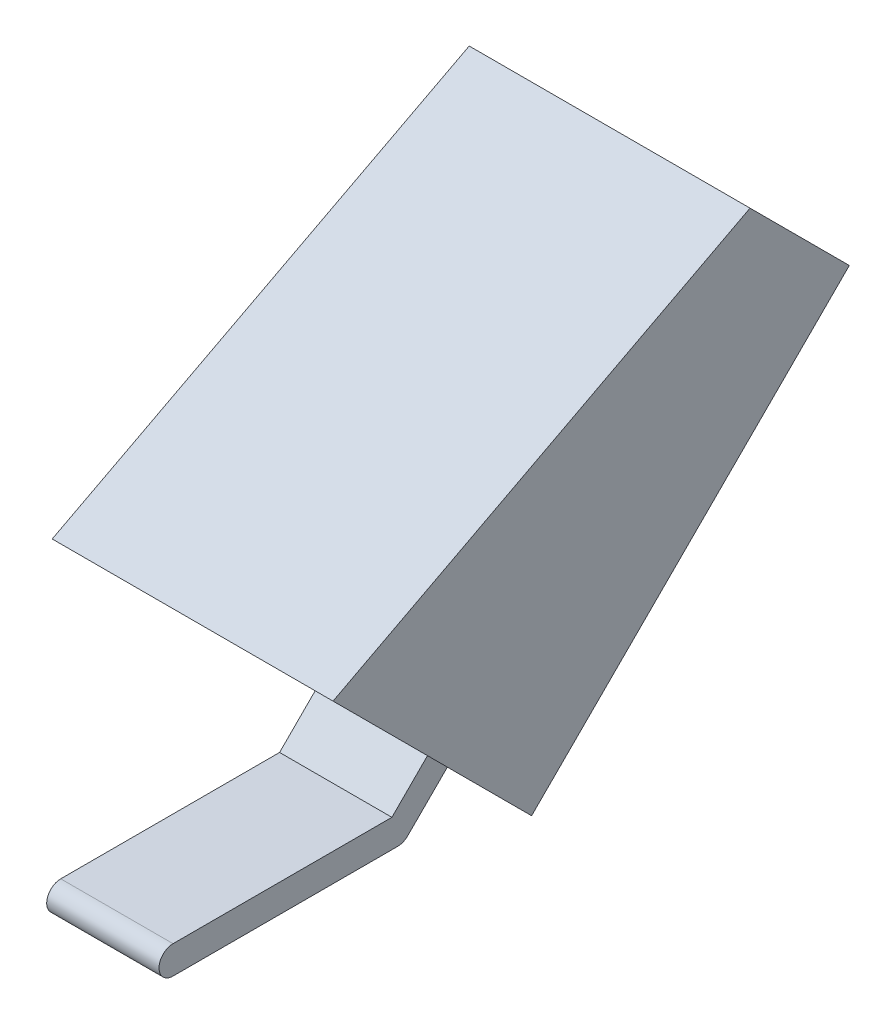
ISO-10303-21;
HEADER;
FILE_DESCRIPTION(('STEP AP214'),'2;1');
FILE_NAME('part.step','',(''),(''),'','','');
FILE_SCHEMA(('AUTOMOTIVE_DESIGN { 1 0 10303 214 1 1 1 1 }'));
ENDSEC;
DATA;
#1=APPLICATION_CONTEXT('core data for automotive mechanical design processes');
#2=APPLICATION_PROTOCOL_DEFINITION('international standard','automotive_design',2000,#1);
#3=PRODUCT_CONTEXT('',#1,'mechanical');
#4=PRODUCT('Part','Part','',(#3));
#5=PRODUCT_RELATED_PRODUCT_CATEGORY('part','',(#4));
#6=PRODUCT_DEFINITION_FORMATION('','',#4);
#7=PRODUCT_DEFINITION_CONTEXT('part definition',#1,'design');
#8=PRODUCT_DEFINITION('design','',#6,#7);
#9=PRODUCT_DEFINITION_SHAPE('','',#8);
#10=(LENGTH_UNIT() NAMED_UNIT(*) SI_UNIT(.MILLI.,.METRE.));
#11=(NAMED_UNIT(*) PLANE_ANGLE_UNIT() SI_UNIT($,.RADIAN.));
#12=(NAMED_UNIT(*) SI_UNIT($,.STERADIAN.) SOLID_ANGLE_UNIT());
#13=UNCERTAINTY_MEASURE_WITH_UNIT(LENGTH_MEASURE(1.E-05),#10,'distance_accuracy_value','');
#14=(GEOMETRIC_REPRESENTATION_CONTEXT(3) GLOBAL_UNCERTAINTY_ASSIGNED_CONTEXT((#13)) GLOBAL_UNIT_ASSIGNED_CONTEXT((#10,
#11,#12)) REPRESENTATION_CONTEXT('',''));
#15=CARTESIAN_POINT('',(0.,0.,0.));
#16=DIRECTION('',(0.,0.,1.));
#17=DIRECTION('',(1.,0.,0.));
#18=AXIS2_PLACEMENT_3D('',#15,#16,#17);
#19=CARTESIAN_POINT('',(4.,-4.70710678118654,-4.70710678118656));
#20=DIRECTION('',(0.,0.707106781186546,0.707106781186549));
#21=DIRECTION('',(0.,-0.707106781186549,0.707106781186546));
#22=AXIS2_PLACEMENT_3D('',#19,#20,#21);
#23=PLANE('',#22);
#24=DIRECTION('',(0.,0.707106781186549,-0.707106781186546));
#25=VECTOR('',#24,1.);
#26=CARTESIAN_POINT('',(-4.,-4.70710678118654,-4.70710678118656));
#27=LINE('',#26,#25);
#28=CARTESIAN_POINT('',(-4.,-0.707106781186542,-8.70710678118655));
#29=VERTEX_POINT('',#28);
#30=CARTESIAN_POINT('',(-4.,2.12132034355965,-11.5355339059327));
#31=VERTEX_POINT('',#30);
#32=EDGE_CURVE('E118',#29,#31,#27,.T.);
#33=ORIENTED_EDGE('',*,*,#32,.T.);
#34=DIRECTION('',(-1.,0.,0.));
#35=VECTOR('',#34,1.);
#36=CARTESIAN_POINT('',(-10.,2.12132034355965,-11.5355339059327));
#37=LINE('',#36,#35);
#38=CARTESIAN_POINT('',(-10.,2.12132034355965,-11.5355339059327));
#39=VERTEX_POINT('',#38);
#40=EDGE_CURVE('E152',#31,#39,#37,.T.);
#41=ORIENTED_EDGE('',*,*,#40,.T.);
#42=DIRECTION('',(0.,0.707106781186549,-0.707106781186546));
#43=VECTOR('',#42,1.);
#44=CARTESIAN_POINT('',(-10.,2.12132034355965,-11.5355339059327));
#45=LINE('',#44,#43);
#46=CARTESIAN_POINT('',(-10.,24.7487373415292,-34.1629509039022));
#47=VERTEX_POINT('',#46);
#48=EDGE_CURVE('E203',#39,#47,#45,.T.);
#49=ORIENTED_EDGE('',*,*,#48,.T.);
#50=DIRECTION('',(1.,0.,0.));
#51=VECTOR('',#50,1.);
#52=CARTESIAN_POINT('',(-10.,24.7487373415292,-34.1629509039022));
#53=LINE('',#52,#51);
#54=CARTESIAN_POINT('',(10.,24.7487373415292,-34.1629509039022));
#55=VERTEX_POINT('',#54);
#56=EDGE_CURVE('E232',#47,#55,#53,.T.);
#57=ORIENTED_EDGE('',*,*,#56,.T.);
#58=DIRECTION('',(0.,-0.707106781186549,0.707106781186546));
#59=VECTOR('',#58,1.);
#60=CARTESIAN_POINT('',(10.,2.12132034355965,-11.5355339059327));
#61=LINE('',#60,#59);
#62=CARTESIAN_POINT('',(10.,2.12132034355965,-11.5355339059327));
#63=VERTEX_POINT('',#62);
#64=EDGE_CURVE('E207',#55,#63,#61,.T.);
#65=ORIENTED_EDGE('',*,*,#64,.T.);
#66=CARTESIAN_POINT('',(4.,2.12132034355965,-11.5355339059327));
#67=VERTEX_POINT('',#66);
#68=EDGE_CURVE('E223',#63,#67,#37,.T.);
#69=ORIENTED_EDGE('',*,*,#68,.T.);
#70=DIRECTION('',(0.,0.707106781186549,-0.707106781186546));
#71=VECTOR('',#70,1.);
#72=CARTESIAN_POINT('',(4.,-4.70710678118654,-4.70710678118656));
#73=LINE('',#72,#71);
#74=CARTESIAN_POINT('',(4.,-0.707106781186542,-8.70710678118655));
#75=VERTEX_POINT('',#74);
#76=EDGE_CURVE('E131',#75,#67,#73,.T.);
#77=ORIENTED_EDGE('',*,*,#76,.F.);
#78=DIRECTION('',(-1.,0.,0.));
#79=VECTOR('',#78,1.);
#80=CARTESIAN_POINT('',(4.,-0.707106781186542,-8.70710678118655));
#81=LINE('',#80,#79);
#82=EDGE_CURVE('E114',#75,#29,#81,.T.);
#83=ORIENTED_EDGE('',*,*,#82,.T.);
#84=EDGE_LOOP('',(#33,#41,#49,#57,#65,#69,#77,#83));
#85=FACE_BOUND('',#84,.T.);
#86=ADVANCED_FACE('F36',(#85),#23,.F.);
#87=CARTESIAN_POINT('',(4.,-3.29289321881345,-3.29289321881346));
#88=DIRECTION('',(0.,0.707106781186546,0.707106781186549));
#89=DIRECTION('',(0.,-0.707106781186549,0.707106781186546));
#90=AXIS2_PLACEMENT_3D('',#87,#88,#89);
#91=PLANE('',#90);
#92=DIRECTION('',(1.,0.,0.));
#93=VECTOR('',#92,1.);
#94=CARTESIAN_POINT('',(4.,3.53553390593274,-10.1213203435596));
#95=LINE('',#94,#93);
#96=CARTESIAN_POINT('',(-4.,3.53553390593274,-10.1213203435596));
#97=VERTEX_POINT('',#96);
#98=CARTESIAN_POINT('',(4.,3.53553390593274,-10.1213203435596));
#99=VERTEX_POINT('',#98);
#100=EDGE_CURVE('E141',#97,#99,#95,.T.);
#101=ORIENTED_EDGE('',*,*,#100,.F.);
#102=DIRECTION('',(0.,0.707106781186549,-0.707106781186546));
#103=VECTOR('',#102,1.);
#104=CARTESIAN_POINT('',(-4.,-3.29289321881345,-3.29289321881346));
#105=LINE('',#104,#103);
#106=CARTESIAN_POINT('',(-4.,1.,-7.5857864376269));
#107=VERTEX_POINT('',#106);
#108=EDGE_CURVE('E121',#107,#97,#105,.T.);
#109=ORIENTED_EDGE('',*,*,#108,.F.);
#110=DIRECTION('',(-1.,0.,0.));
#111=VECTOR('',#110,1.);
#112=CARTESIAN_POINT('',(4.,1.,-7.5857864376269));
#113=LINE('',#112,#111);
#114=CARTESIAN_POINT('',(4.,1.,-7.5857864376269));
#115=VERTEX_POINT('',#114);
#116=EDGE_CURVE('E44',#115,#107,#113,.T.);
#117=ORIENTED_EDGE('',*,*,#116,.F.);
#118=DIRECTION('',(0.,0.707106781186549,-0.707106781186546));
#119=VECTOR('',#118,1.);
#120=CARTESIAN_POINT('',(4.,-3.29289321881345,-3.29289321881346));
#121=LINE('',#120,#119);
#122=EDGE_CURVE('E219',#115,#99,#121,.T.);
#123=ORIENTED_EDGE('',*,*,#122,.T.);
#124=EDGE_LOOP('',(#101,#109,#117,#123));
#125=FACE_BOUND('',#124,.T.);
#126=ADVANCED_FACE('F138',(#125),#91,.T.);
#127=CARTESIAN_POINT('',(4.,1.,0.));
#128=DIRECTION('',(0.,1.,0.));
#129=DIRECTION('',(0.,0.,1.));
#130=AXIS2_PLACEMENT_3D('',#127,#128,#129);
#131=PLANE('',#130);
#132=DIRECTION('',(0.,0.,-1.));
#133=VECTOR('',#132,1.);
#134=CARTESIAN_POINT('',(-4.,1.,0.));
#135=LINE('',#134,#133);
#136=CARTESIAN_POINT('',(-4.,1.,8.));
#137=VERTEX_POINT('',#136);
#138=EDGE_CURVE('E125',#137,#107,#135,.T.);
#139=ORIENTED_EDGE('',*,*,#138,.F.);
#140=DIRECTION('',(-1.,0.,0.));
#141=VECTOR('',#140,1.);
#142=CARTESIAN_POINT('',(4.,1.,8.));
#143=LINE('',#142,#141);
#144=CARTESIAN_POINT('',(4.,1.,8.));
#145=VERTEX_POINT('',#144);
#146=EDGE_CURVE('E109',#145,#137,#143,.T.);
#147=ORIENTED_EDGE('',*,*,#146,.F.);
#148=DIRECTION('',(0.,0.,-1.));
#149=VECTOR('',#148,1.);
#150=CARTESIAN_POINT('',(4.,1.,0.));
#151=LINE('',#150,#149);
#152=EDGE_CURVE('E102',#145,#115,#151,.T.);
#153=ORIENTED_EDGE('',*,*,#152,.T.);
#154=ORIENTED_EDGE('',*,*,#116,.T.);
#155=EDGE_LOOP('',(#139,#147,#153,#154));
#156=FACE_BOUND('',#155,.T.);
#157=ADVANCED_FACE('F136',(#156),#131,.T.);
#158=CARTESIAN_POINT('',(4.,0.,8.));
#159=DIRECTION('',(-1.,0.,0.));
#160=DIRECTION('',(0.,0.,1.));
#161=AXIS2_PLACEMENT_3D('',#158,#159,#160);
#162=CYLINDRICAL_SURFACE('',#161,1.);
#163=CARTESIAN_POINT('',(-4.,0.,8.));
#164=DIRECTION('',(1.,0.,0.));
#165=DIRECTION('',(0.,0.,-1.));
#166=AXIS2_PLACEMENT_3D('',#163,#164,#165);
#167=CIRCLE('',#166,1.);
#168=CARTESIAN_POINT('',(-4.,-1.,8.));
#169=VERTEX_POINT('',#168);
#170=EDGE_CURVE('E108',#137,#169,#167,.T.);
#171=ORIENTED_EDGE('',*,*,#170,.T.);
#172=DIRECTION('',(-1.,0.,0.));
#173=VECTOR('',#172,1.);
#174=CARTESIAN_POINT('',(4.,-1.,8.));
#175=LINE('',#174,#173);
#176=CARTESIAN_POINT('',(4.,-1.,8.));
#177=VERTEX_POINT('',#176);
#178=EDGE_CURVE('E105',#177,#169,#175,.T.);
#179=ORIENTED_EDGE('',*,*,#178,.F.);
#180=CARTESIAN_POINT('',(4.,0.,8.));
#181=DIRECTION('',(1.,0.,0.));
#182=DIRECTION('',(0.,0.,-1.));
#183=AXIS2_PLACEMENT_3D('',#180,#181,#182);
#184=CIRCLE('',#183,1.);
#185=EDGE_CURVE('E95',#145,#177,#184,.T.);
#186=ORIENTED_EDGE('',*,*,#185,.F.);
#187=ORIENTED_EDGE('',*,*,#146,.T.);
#188=EDGE_LOOP('',(#171,#179,#186,#187));
#189=FACE_BOUND('',#188,.T.);
#190=ADVANCED_FACE('F106',(#189),#162,.T.);
#191=CARTESIAN_POINT('',(4.,-0.999999999999999,0.));
#192=DIRECTION('',(0.,1.,0.));
#193=DIRECTION('',(0.,0.,1.));
#194=AXIS2_PLACEMENT_3D('',#191,#192,#193);
#195=PLANE('',#194);
#196=DIRECTION('',(0.,0.,-1.));
#197=VECTOR('',#196,1.);
#198=CARTESIAN_POINT('',(-4.,-0.999999999999999,0.));
#199=LINE('',#198,#197);
#200=CARTESIAN_POINT('',(-4.,-0.999999999999997,-8.));
#201=VERTEX_POINT('',#200);
#202=EDGE_CURVE('E73',#169,#201,#199,.T.);
#203=ORIENTED_EDGE('',*,*,#202,.T.);
#204=DIRECTION('',(-1.,0.,0.));
#205=VECTOR('',#204,1.);
#206=CARTESIAN_POINT('',(4.,-0.999999999999997,-8.));
#207=LINE('',#206,#205);
#208=CARTESIAN_POINT('',(4.,-0.999999999999997,-8.));
#209=VERTEX_POINT('',#208);
#210=EDGE_CURVE('E110',#209,#201,#207,.T.);
#211=ORIENTED_EDGE('',*,*,#210,.F.);
#212=DIRECTION('',(0.,0.,-1.));
#213=VECTOR('',#212,1.);
#214=CARTESIAN_POINT('',(4.,-0.999999999999999,0.));
#215=LINE('',#214,#213);
#216=EDGE_CURVE('E100',#177,#209,#215,.T.);
#217=ORIENTED_EDGE('',*,*,#216,.F.);
#218=ORIENTED_EDGE('',*,*,#178,.T.);
#219=EDGE_LOOP('',(#203,#211,#217,#218));
#220=FACE_BOUND('',#219,.T.);
#221=ADVANCED_FACE('F112',(#220),#195,.F.);
#222=CARTESIAN_POINT('',(4.,0.,-8.));
#223=DIRECTION('',(-1.,0.,0.));
#224=DIRECTION('',(0.,0.,1.));
#225=AXIS2_PLACEMENT_3D('',#222,#223,#224);
#226=CYLINDRICAL_SURFACE('',#225,1.);
#227=CARTESIAN_POINT('',(-4.,0.,-8.));
#228=DIRECTION('',(1.,0.,0.));
#229=DIRECTION('',(0.,0.,-1.));
#230=AXIS2_PLACEMENT_3D('',#227,#228,#229);
#231=CIRCLE('',#230,1.);
#232=EDGE_CURVE('E79',#201,#29,#231,.T.);
#233=ORIENTED_EDGE('',*,*,#232,.T.);
#234=ORIENTED_EDGE('',*,*,#82,.F.);
#235=CARTESIAN_POINT('',(4.,0.,-8.));
#236=DIRECTION('',(1.,0.,0.));
#237=DIRECTION('',(0.,0.,-1.));
#238=AXIS2_PLACEMENT_3D('',#235,#236,#237);
#239=CIRCLE('',#238,1.);
#240=EDGE_CURVE('E52',#209,#75,#239,.T.);
#241=ORIENTED_EDGE('',*,*,#240,.F.);
#242=ORIENTED_EDGE('',*,*,#210,.T.);
#243=EDGE_LOOP('',(#233,#234,#241,#242));
#244=FACE_BOUND('',#243,.T.);
#245=ADVANCED_FACE('F258',(#244),#226,.T.);
#246=CARTESIAN_POINT('',(4.,0.,0.));
#247=DIRECTION('',(1.,0.,0.));
#248=DIRECTION('',(0.,0.,-1.));
#249=AXIS2_PLACEMENT_3D('',#246,#247,#248);
#250=PLANE('',#249);
#251=DIRECTION('',(0.,-0.707106781186546,-0.707106781186549));
#252=VECTOR('',#251,1.);
#253=CARTESIAN_POINT('',(4.,6.8284271247462,-6.82842712474617));
#254=LINE('',#253,#252);
#255=EDGE_CURVE('E122',#99,#67,#254,.T.);
#256=ORIENTED_EDGE('',*,*,#255,.F.);
#257=ORIENTED_EDGE('',*,*,#122,.F.);
#258=ORIENTED_EDGE('',*,*,#152,.F.);
#259=ORIENTED_EDGE('',*,*,#185,.T.);
#260=ORIENTED_EDGE('',*,*,#216,.T.);
#261=ORIENTED_EDGE('',*,*,#240,.T.);
#262=ORIENTED_EDGE('',*,*,#76,.T.);
#263=EDGE_LOOP('',(#256,#257,#258,#259,#260,#261,#262));
#264=FACE_BOUND('',#263,.T.);
#265=ADVANCED_FACE('F98',(#264),#250,.T.);
#266=CARTESIAN_POINT('',(-4.,0.,0.));
#267=DIRECTION('',(1.,0.,0.));
#268=DIRECTION('',(0.,0.,-1.));
#269=AXIS2_PLACEMENT_3D('',#266,#267,#268);
#270=PLANE('',#269);
#271=ORIENTED_EDGE('',*,*,#108,.T.);
#272=DIRECTION('',(0.,-0.707106781186546,-0.707106781186549));
#273=VECTOR('',#272,1.);
#274=CARTESIAN_POINT('',(-4.,6.8284271247462,-6.82842712474617));
#275=LINE('',#274,#273);
#276=EDGE_CURVE('E11',#97,#31,#275,.T.);
#277=ORIENTED_EDGE('',*,*,#276,.T.);
#278=ORIENTED_EDGE('',*,*,#32,.F.);
#279=ORIENTED_EDGE('',*,*,#232,.F.);
#280=ORIENTED_EDGE('',*,*,#202,.F.);
#281=ORIENTED_EDGE('',*,*,#170,.F.);
#282=ORIENTED_EDGE('',*,*,#138,.T.);
#283=EDGE_LOOP('',(#271,#277,#278,#279,#280,#281,#282));
#284=FACE_BOUND('',#283,.T.);
#285=ADVANCED_FACE('F143',(#284),#270,.F.);
#286=CARTESIAN_POINT('',(-10.,16.2634559672906,2.60660171779824));
#287=DIRECTION('',(-1.,0.,0.));
#288=DIRECTION('',(0.,-1.,0.));
#289=AXIS2_PLACEMENT_3D('',#286,#287,#288);
#290=PLANE('',#289);
#291=DIRECTION('',(0.,-0.464006994670559,0.885831535280154));
#292=VECTOR('',#291,1.);
#293=CARTESIAN_POINT('',(-10.,16.2634559672906,2.60660171779824));
#294=LINE('',#293,#292);
#295=CARTESIAN_POINT('',(-10.,31.8198051533947,-27.0918830920367));
#296=VERTEX_POINT('',#295);
#297=CARTESIAN_POINT('',(-10.,16.2634559672906,2.60660171779824));
#298=VERTEX_POINT('',#297);
#299=EDGE_CURVE('E194',#296,#298,#294,.T.);
#300=ORIENTED_EDGE('',*,*,#299,.F.);
#301=DIRECTION('',(0.,-0.707106781186546,-0.707106781186549));
#302=VECTOR('',#301,1.);
#303=CARTESIAN_POINT('',(-10.,38.8908729652601,-20.0208152801712));
#304=LINE('',#303,#302);
#305=EDGE_CURVE('E202',#296,#47,#304,.T.);
#306=ORIENTED_EDGE('',*,*,#305,.T.);
#307=ORIENTED_EDGE('',*,*,#48,.F.);
#308=DIRECTION('',(0.,-0.707106781186546,-0.707106781186549));
#309=VECTOR('',#308,1.);
#310=CARTESIAN_POINT('',(-10.,16.2634559672906,2.60660171779824));
#311=LINE('',#310,#309);
#312=EDGE_CURVE('E211',#298,#39,#311,.T.);
#313=ORIENTED_EDGE('',*,*,#312,.F.);
#314=EDGE_LOOP('',(#300,#306,#307,#313));
#315=FACE_BOUND('',#314,.T.);
#316=ADVANCED_FACE('F231',(#315),#290,.T.);
#317=CARTESIAN_POINT('',(-10.,16.2634559672906,2.60660171779824));
#318=DIRECTION('',(0.,-0.707106781186549,0.707106781186546));
#319=DIRECTION('',(0.,-0.707106781186546,-0.707106781186549));
#320=AXIS2_PLACEMENT_3D('',#317,#318,#319);
#321=PLANE('',#320);
#322=ORIENTED_EDGE('',*,*,#100,.T.);
#323=ORIENTED_EDGE('',*,*,#255,.T.);
#324=ORIENTED_EDGE('',*,*,#68,.F.);
#325=DIRECTION('',(0.,-0.707106781186546,-0.707106781186549));
#326=VECTOR('',#325,1.);
#327=CARTESIAN_POINT('',(10.,16.2634559672906,2.60660171779824));
#328=LINE('',#327,#326);
#329=CARTESIAN_POINT('',(10.,16.2634559672906,2.60660171779824));
#330=VERTEX_POINT('',#329);
#331=EDGE_CURVE('E209',#330,#63,#328,.T.);
#332=ORIENTED_EDGE('',*,*,#331,.F.);
#333=DIRECTION('',(-1.,0.,0.));
#334=VECTOR('',#333,1.);
#335=CARTESIAN_POINT('',(-10.,16.2634559672906,2.60660171779824));
#336=LINE('',#335,#334);
#337=EDGE_CURVE('E190',#330,#298,#336,.T.);
#338=ORIENTED_EDGE('',*,*,#337,.T.);
#339=ORIENTED_EDGE('',*,*,#312,.T.);
#340=ORIENTED_EDGE('',*,*,#40,.F.);
#341=ORIENTED_EDGE('',*,*,#276,.F.);
#342=EDGE_LOOP('',(#322,#323,#324,#332,#338,#339,#340,#341));
#343=FACE_BOUND('',#342,.T.);
#344=ADVANCED_FACE('F222',(#343),#321,.T.);
#345=CARTESIAN_POINT('',(10.,16.2634559672906,2.60660171779824));
#346=DIRECTION('',(1.,0.,0.));
#347=DIRECTION('',(0.,1.,0.));
#348=AXIS2_PLACEMENT_3D('',#345,#346,#347);
#349=PLANE('',#348);
#350=DIRECTION('',(0.,-0.464006994670559,0.885831535280154));
#351=VECTOR('',#350,1.);
#352=CARTESIAN_POINT('',(10.,16.2634559672906,2.60660171779824));
#353=LINE('',#352,#351);
#354=CARTESIAN_POINT('',(10.,31.8198051533947,-27.0918830920367));
#355=VERTEX_POINT('',#354);
#356=EDGE_CURVE('E184',#355,#330,#353,.T.);
#357=ORIENTED_EDGE('',*,*,#356,.T.);
#358=ORIENTED_EDGE('',*,*,#331,.T.);
#359=ORIENTED_EDGE('',*,*,#64,.F.);
#360=DIRECTION('',(0.,-0.707106781186546,-0.707106781186549));
#361=VECTOR('',#360,1.);
#362=CARTESIAN_POINT('',(10.,38.8908729652601,-20.0208152801712));
#363=LINE('',#362,#361);
#364=EDGE_CURVE('E200',#355,#55,#363,.T.);
#365=ORIENTED_EDGE('',*,*,#364,.F.);
#366=EDGE_LOOP('',(#357,#358,#359,#365));
#367=FACE_BOUND('',#366,.T.);
#368=ADVANCED_FACE('F205',(#367),#349,.T.);
#369=CARTESIAN_POINT('',(-10.,38.8908729652601,-20.0208152801712));
#370=DIRECTION('',(0.,0.707106781186549,-0.707106781186546));
#371=DIRECTION('',(0.,0.707106781186546,0.707106781186549));
#372=AXIS2_PLACEMENT_3D('',#369,#370,#371);
#373=PLANE('',#372);
#374=DIRECTION('',(-1.,0.,0.));
#375=VECTOR('',#374,1.);
#376=CARTESIAN_POINT('',(10.,31.8198051533947,-27.0918830920367));
#377=LINE('',#376,#375);
#378=EDGE_CURVE('E187',#355,#296,#377,.T.);
#379=ORIENTED_EDGE('',*,*,#378,.F.);
#380=ORIENTED_EDGE('',*,*,#364,.T.);
#381=ORIENTED_EDGE('',*,*,#56,.F.);
#382=ORIENTED_EDGE('',*,*,#305,.F.);
#383=EDGE_LOOP('',(#379,#380,#381,#382));
#384=FACE_BOUND('',#383,.T.);
#385=ADVANCED_FACE('F198',(#384),#373,.T.);
#386=CARTESIAN_POINT('',(10.,16.2634559672906,2.60660171779824));
#387=DIRECTION('',(0.,-0.885831535280155,-0.464006994670559));
#388=DIRECTION('',(0.,0.464006994670559,-0.885831535280155));
#389=AXIS2_PLACEMENT_3D('',#386,#387,#388);
#390=PLANE('',#389);
#391=ORIENTED_EDGE('',*,*,#299,.T.);
#392=ORIENTED_EDGE('',*,*,#337,.F.);
#393=ORIENTED_EDGE('',*,*,#356,.F.);
#394=ORIENTED_EDGE('',*,*,#378,.T.);
#395=EDGE_LOOP('',(#391,#392,#393,#394));
#396=FACE_BOUND('',#395,.T.);
#397=ADVANCED_FACE('F186',(#396),#390,.F.);
#398=CLOSED_SHELL('',(#86,#126,#157,#190,#221,#245,#265,#285,#316,#344,#368,#385,#397));
#399=MANIFOLD_SOLID_BREP('B2',#398);
#400=ADVANCED_BREP_SHAPE_REPRESENTATION('',(#18,#399),#14);
#401=SHAPE_DEFINITION_REPRESENTATION(#9,#400);
ENDSEC;
END-ISO-10303-21;
